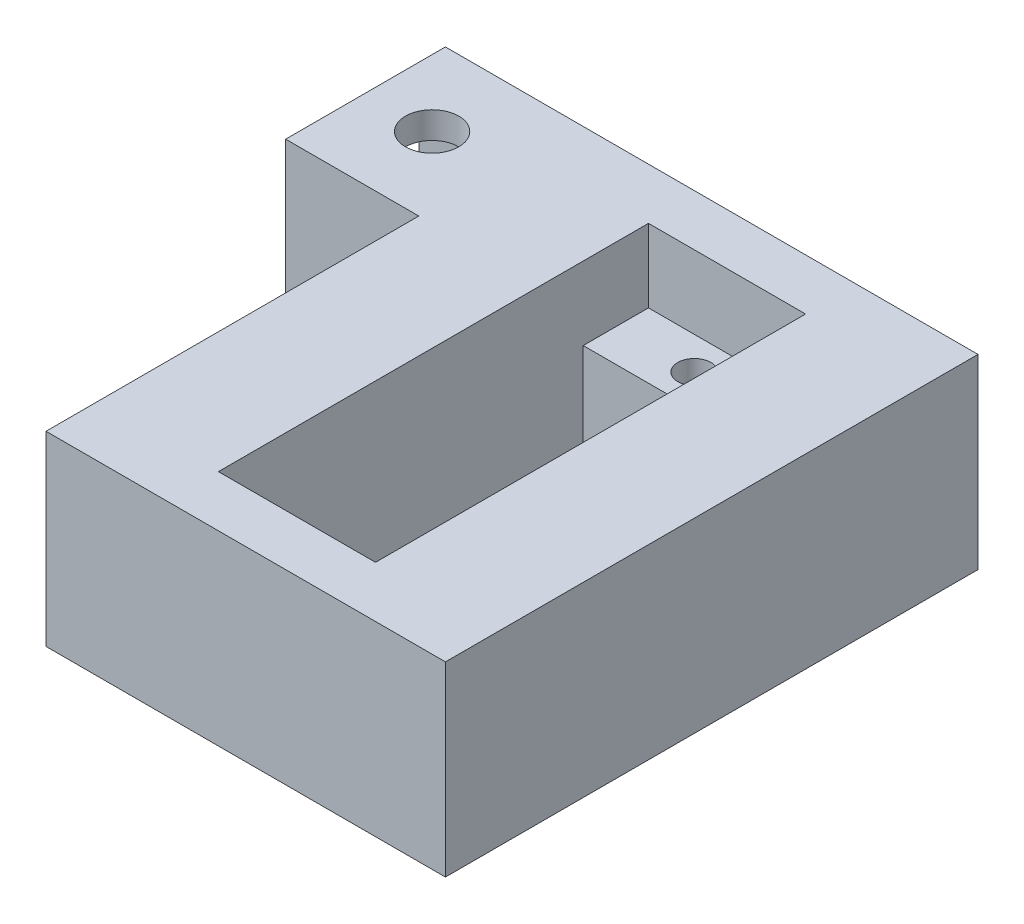
ISO-10303-21;
HEADER;
FILE_DESCRIPTION(('STEP AP214'),'2;1');
FILE_NAME('part.step','',(''),(''),'','','');
FILE_SCHEMA(('AUTOMOTIVE_DESIGN { 1 0 10303 214 1 1 1 1 }'));
ENDSEC;
DATA;
#1=APPLICATION_CONTEXT('core data for automotive mechanical design processes');
#2=APPLICATION_PROTOCOL_DEFINITION('international standard','automotive_design',2000,#1);
#3=PRODUCT_CONTEXT('',#1,'mechanical');
#4=PRODUCT('Part','Part','',(#3));
#5=PRODUCT_RELATED_PRODUCT_CATEGORY('part','',(#4));
#6=PRODUCT_DEFINITION_FORMATION('','',#4);
#7=PRODUCT_DEFINITION_CONTEXT('part definition',#1,'design');
#8=PRODUCT_DEFINITION('design','',#6,#7);
#9=PRODUCT_DEFINITION_SHAPE('','',#8);
#10=(LENGTH_UNIT() NAMED_UNIT(*) SI_UNIT(.MILLI.,.METRE.));
#11=(NAMED_UNIT(*) PLANE_ANGLE_UNIT() SI_UNIT($,.RADIAN.));
#12=(NAMED_UNIT(*) SI_UNIT($,.STERADIAN.) SOLID_ANGLE_UNIT());
#13=UNCERTAINTY_MEASURE_WITH_UNIT(LENGTH_MEASURE(1.E-05),#10,'distance_accuracy_value','');
#14=(GEOMETRIC_REPRESENTATION_CONTEXT(3) GLOBAL_UNCERTAINTY_ASSIGNED_CONTEXT((#13)) GLOBAL_UNIT_ASSIGNED_CONTEXT((#10,
#11,#12)) REPRESENTATION_CONTEXT('',''));
#15=CARTESIAN_POINT('',(0.,0.,0.));
#16=DIRECTION('',(0.,0.,1.));
#17=DIRECTION('',(1.,0.,0.));
#18=AXIS2_PLACEMENT_3D('',#15,#16,#17);
#19=CARTESIAN_POINT('',(-21.329047434942,9.00358715260278,40.));
#20=DIRECTION('',(1.,0.,0.));
#21=DIRECTION('',(0.,0.,-1.));
#22=AXIS2_PLACEMENT_3D('',#19,#20,#21);
#23=PLANE('',#22);
#24=DIRECTION('',(0.,1.,0.));
#25=VECTOR('',#24,1.);
#26=CARTESIAN_POINT('',(-21.329047434942,9.00358715260278,12.));
#27=LINE('',#26,#25);
#28=CARTESIAN_POINT('',(-21.329047434942,-4.99526108798895,12.));
#29=VERTEX_POINT('',#28);
#30=CARTESIAN_POINT('',(-21.329047434942,9.00358715260278,12.));
#31=VERTEX_POINT('',#30);
#32=EDGE_CURVE('E66',#29,#31,#27,.T.);
#33=ORIENTED_EDGE('',*,*,#32,.F.);
#34=DIRECTION('',(0.,0.,-1.));
#35=VECTOR('',#34,1.);
#36=CARTESIAN_POINT('',(-21.329047434942,-4.99526108798895,40.));
#37=LINE('',#36,#35);
#38=CARTESIAN_POINT('',(-21.329047434942,-4.99526108798895,40.));
#39=VERTEX_POINT('',#38);
#40=EDGE_CURVE('E370',#39,#29,#37,.T.);
#41=ORIENTED_EDGE('',*,*,#40,.F.);
#42=DIRECTION('',(0.,-1.,0.));
#43=VECTOR('',#42,1.);
#44=CARTESIAN_POINT('',(-21.329047434942,9.00358715260278,40.));
#45=LINE('',#44,#43);
#46=CARTESIAN_POINT('',(-21.329047434942,9.00358715260278,40.));
#47=VERTEX_POINT('',#46);
#48=EDGE_CURVE('E352',#47,#39,#45,.T.);
#49=ORIENTED_EDGE('',*,*,#48,.F.);
#50=DIRECTION('',(0.,0.,-1.));
#51=VECTOR('',#50,1.);
#52=CARTESIAN_POINT('',(-21.329047434942,9.00358715260278,40.));
#53=LINE('',#52,#51);
#54=EDGE_CURVE('E50',#47,#31,#53,.T.);
#55=ORIENTED_EDGE('',*,*,#54,.T.);
#56=EDGE_LOOP('',(#33,#41,#49,#55));
#57=FACE_BOUND('',#56,.T.);
#58=ADVANCED_FACE('F40',(#57),#23,.F.);
#59=CARTESIAN_POINT('',(0.,3.50358715260278,0.));
#60=DIRECTION('',(0.,1.,0.));
#61=DIRECTION('',(0.,0.,1.));
#62=AXIS2_PLACEMENT_3D('',#59,#60,#61);
#63=PLANE('',#62);
#64=CARTESIAN_POINT('',(-6.32904743494199,3.50358715260278,33.7));
#65=DIRECTION('',(0.,1.,0.));
#66=DIRECTION('',(0.,0.,1.));
#67=AXIS2_PLACEMENT_3D('',#64,#65,#66);
#68=CIRCLE('',#67,1.25);
#69=CARTESIAN_POINT('',(-6.32904743494199,3.50358715260278,34.95));
#70=VERTEX_POINT('',#69);
#71=EDGE_CURVE('E245',#70,#70,#68,.T.);
#72=ORIENTED_EDGE('',*,*,#71,.F.);
#73=EDGE_LOOP('',(#72));
#74=FACE_BOUND('',#73,.T.);
#75=DIRECTION('',(1.,0.,0.));
#76=VECTOR('',#75,1.);
#77=CARTESIAN_POINT('',(-12.229047434942,3.50358715260278,31.25));
#78=LINE('',#77,#76);
#79=CARTESIAN_POINT('',(-12.229047434942,3.50358715260278,31.25));
#80=VERTEX_POINT('',#79);
#81=CARTESIAN_POINT('',(-0.429047434941994,3.50358715260278,31.25));
#82=VERTEX_POINT('',#81);
#83=EDGE_CURVE('E250',#80,#82,#78,.T.);
#84=ORIENTED_EDGE('',*,*,#83,.F.);
#85=DIRECTION('',(0.,0.,1.));
#86=VECTOR('',#85,1.);
#87=CARTESIAN_POINT('',(-12.229047434942,3.50358715260278,3.85));
#88=LINE('',#87,#86);
#89=CARTESIAN_POINT('',(-12.229047434942,3.50358715260278,36.15));
#90=VERTEX_POINT('',#89);
#91=EDGE_CURVE('E303',#80,#90,#88,.T.);
#92=ORIENTED_EDGE('',*,*,#91,.T.);
#93=DIRECTION('',(1.,0.,0.));
#94=VECTOR('',#93,1.);
#95=CARTESIAN_POINT('',(-12.229047434942,3.50358715260278,36.15));
#96=LINE('',#95,#94);
#97=CARTESIAN_POINT('',(-0.429047434941994,3.50358715260278,36.15));
#98=VERTEX_POINT('',#97);
#99=EDGE_CURVE('E302',#90,#98,#96,.T.);
#100=ORIENTED_EDGE('',*,*,#99,.T.);
#101=DIRECTION('',(0.,0.,-1.));
#102=VECTOR('',#101,1.);
#103=CARTESIAN_POINT('',(-0.429047434941994,3.50358715260278,3.85));
#104=LINE('',#103,#102);
#105=EDGE_CURVE('E308',#98,#82,#104,.T.);
#106=ORIENTED_EDGE('',*,*,#105,.T.);
#107=EDGE_LOOP('',(#84,#92,#100,#106));
#108=FACE_BOUND('',#107,.T.);
#109=ADVANCED_FACE('F414',(#74,#108),#63,.T.);
#110=CARTESIAN_POINT('',(8.67095256505801,9.00358715260278,40.));
#111=DIRECTION('',(1.,0.,0.));
#112=DIRECTION('',(0.,0.,-1.));
#113=AXIS2_PLACEMENT_3D('',#110,#111,#112);
#114=PLANE('',#113);
#115=DIRECTION('',(0.,-1.,0.));
#116=VECTOR('',#115,1.);
#117=CARTESIAN_POINT('',(8.67095256505801,9.00358715260278,0.));
#118=LINE('',#117,#116);
#119=CARTESIAN_POINT('',(8.67095256505801,9.00358715260278,0.));
#120=VERTEX_POINT('',#119);
#121=CARTESIAN_POINT('',(8.67095256505801,-4.99526108798895,0.));
#122=VERTEX_POINT('',#121);
#123=EDGE_CURVE('E334',#120,#122,#118,.T.);
#124=ORIENTED_EDGE('',*,*,#123,.F.);
#125=DIRECTION('',(0.,0.,-1.));
#126=VECTOR('',#125,1.);
#127=CARTESIAN_POINT('',(8.67095256505801,9.00358715260278,40.));
#128=LINE('',#127,#126);
#129=CARTESIAN_POINT('',(8.67095256505801,9.00358715260278,40.));
#130=VERTEX_POINT('',#129);
#131=EDGE_CURVE('E11',#130,#120,#128,.T.);
#132=ORIENTED_EDGE('',*,*,#131,.F.);
#133=DIRECTION('',(0.,-1.,0.));
#134=VECTOR('',#133,1.);
#135=CARTESIAN_POINT('',(8.67095256505801,9.00358715260278,40.));
#136=LINE('',#135,#134);
#137=CARTESIAN_POINT('',(8.67095256505801,-4.99526108798895,40.));
#138=VERTEX_POINT('',#137);
#139=EDGE_CURVE('E344',#130,#138,#136,.T.);
#140=ORIENTED_EDGE('',*,*,#139,.T.);
#141=DIRECTION('',(0.,0.,-1.));
#142=VECTOR('',#141,1.);
#143=CARTESIAN_POINT('',(8.67095256505801,-4.99526108798895,40.));
#144=LINE('',#143,#142);
#145=EDGE_CURVE('E359',#138,#122,#144,.T.);
#146=ORIENTED_EDGE('',*,*,#145,.T.);
#147=EDGE_LOOP('',(#124,#132,#140,#146));
#148=FACE_BOUND('',#147,.T.);
#149=ADVANCED_FACE('F42',(#148),#114,.T.);
#150=CARTESIAN_POINT('',(8.67095256505801,9.00358715260278,40.));
#151=DIRECTION('',(0.,-1.,0.));
#152=DIRECTION('',(0.,0.,-1.));
#153=AXIS2_PLACEMENT_3D('',#150,#151,#152);
#154=PLANE('',#153);
#155=CARTESIAN_POINT('',(-26.329047434942,9.00358715260278,6.));
#156=DIRECTION('',(0.,1.,0.));
#157=DIRECTION('',(0.,0.,1.));
#158=AXIS2_PLACEMENT_3D('',#155,#156,#157);
#159=CIRCLE('',#158,2.);
#160=CARTESIAN_POINT('',(-26.329047434942,9.00358715260278,8.));
#161=VERTEX_POINT('',#160);
#162=EDGE_CURVE('E490',#161,#161,#159,.T.);
#163=ORIENTED_EDGE('',*,*,#162,.F.);
#164=EDGE_LOOP('',(#163));
#165=FACE_BOUND('',#164,.T.);
#166=DIRECTION('',(1.,0.,0.));
#167=VECTOR('',#166,1.);
#168=CARTESIAN_POINT('',(-12.229047434942,9.00358715260278,36.15));
#169=LINE('',#168,#167);
#170=CARTESIAN_POINT('',(-12.229047434942,9.00358715260278,36.15));
#171=VERTEX_POINT('',#170);
#172=CARTESIAN_POINT('',(-0.429047434941994,9.00358715260278,36.15));
#173=VERTEX_POINT('',#172);
#174=EDGE_CURVE('E319',#171,#173,#169,.T.);
#175=ORIENTED_EDGE('',*,*,#174,.F.);
#176=DIRECTION('',(0.,0.,1.));
#177=VECTOR('',#176,1.);
#178=CARTESIAN_POINT('',(-12.229047434942,9.00358715260278,3.85));
#179=LINE('',#178,#177);
#180=CARTESIAN_POINT('',(-12.229047434942,9.00358715260278,3.85));
#181=VERTEX_POINT('',#180);
#182=EDGE_CURVE('E289',#181,#171,#179,.T.);
#183=ORIENTED_EDGE('',*,*,#182,.F.);
#184=DIRECTION('',(-1.,0.,0.));
#185=VECTOR('',#184,1.);
#186=CARTESIAN_POINT('',(-12.229047434942,9.00358715260278,3.85));
#187=LINE('',#186,#185);
#188=CARTESIAN_POINT('',(-0.429047434941994,9.00358715260278,3.85));
#189=VERTEX_POINT('',#188);
#190=EDGE_CURVE('E327',#189,#181,#187,.T.);
#191=ORIENTED_EDGE('',*,*,#190,.F.);
#192=DIRECTION('',(0.,0.,-1.));
#193=VECTOR('',#192,1.);
#194=CARTESIAN_POINT('',(-0.429047434941994,9.00358715260278,3.85));
#195=LINE('',#194,#193);
#196=EDGE_CURVE('E323',#173,#189,#195,.T.);
#197=ORIENTED_EDGE('',*,*,#196,.F.);
#198=EDGE_LOOP('',(#175,#183,#191,#197));
#199=FACE_BOUND('',#198,.T.);
#200=DIRECTION('',(-1.,0.,0.));
#201=VECTOR('',#200,1.);
#202=CARTESIAN_POINT('',(8.67095256505801,9.00358715260278,0.));
#203=LINE('',#202,#201);
#204=CARTESIAN_POINT('',(-31.329047434942,9.00358715260278,0.));
#205=VERTEX_POINT('',#204);
#206=EDGE_CURVE('E349',#120,#205,#203,.T.);
#207=ORIENTED_EDGE('',*,*,#206,.T.);
#208=DIRECTION('',(0.,0.,-1.));
#209=VECTOR('',#208,1.);
#210=CARTESIAN_POINT('',(-31.329047434942,9.00358715260278,0.));
#211=LINE('',#210,#209);
#212=CARTESIAN_POINT('',(-31.329047434942,9.00358715260278,12.));
#213=VERTEX_POINT('',#212);
#214=EDGE_CURVE('E231',#213,#205,#211,.T.);
#215=ORIENTED_EDGE('',*,*,#214,.F.);
#216=DIRECTION('',(1.,0.,0.));
#217=VECTOR('',#216,1.);
#218=CARTESIAN_POINT('',(-31.329047434942,9.00358715260278,12.));
#219=LINE('',#218,#217);
#220=EDGE_CURVE('E235',#213,#31,#219,.T.);
#221=ORIENTED_EDGE('',*,*,#220,.T.);
#222=ORIENTED_EDGE('',*,*,#54,.F.);
#223=DIRECTION('',(-1.,0.,0.));
#224=VECTOR('',#223,1.);
#225=CARTESIAN_POINT('',(-11.329047434942,9.00358715260278,40.));
#226=LINE('',#225,#224);
#227=EDGE_CURVE('E356',#130,#47,#226,.T.);
#228=ORIENTED_EDGE('',*,*,#227,.F.);
#229=ORIENTED_EDGE('',*,*,#131,.T.);
#230=EDGE_LOOP('',(#207,#215,#221,#222,#228,#229));
#231=FACE_BOUND('',#230,.T.);
#232=ADVANCED_FACE('F387',(#165,#199,#231),#154,.F.);
#233=CARTESIAN_POINT('',(-21.329047434942,-4.99526108798895,40.));
#234=DIRECTION('',(0.,1.,0.));
#235=DIRECTION('',(0.,0.,1.));
#236=AXIS2_PLACEMENT_3D('',#233,#234,#235);
#237=PLANE('',#236);
#238=CARTESIAN_POINT('',(-26.329047434942,-4.99526108798895,6.));
#239=DIRECTION('',(0.,1.,0.));
#240=DIRECTION('',(0.,0.,1.));
#241=AXIS2_PLACEMENT_3D('',#238,#239,#240);
#242=CIRCLE('',#241,2.);
#243=CARTESIAN_POINT('',(-26.329047434942,-4.99526108798895,8.));
#244=VERTEX_POINT('',#243);
#245=EDGE_CURVE('E496',#244,#244,#242,.T.);
#246=ORIENTED_EDGE('',*,*,#245,.T.);
#247=EDGE_LOOP('',(#246));
#248=FACE_BOUND('',#247,.T.);
#249=CARTESIAN_POINT('',(-6.329047434942,-4.99526108798895,6.3));
#250=DIRECTION('',(0.,1.,0.));
#251=DIRECTION('',(0.,0.,1.));
#252=AXIS2_PLACEMENT_3D('',#249,#250,#251);
#253=CIRCLE('',#252,1.25);
#254=CARTESIAN_POINT('',(-6.329047434942,-4.99526108798895,7.55));
#255=VERTEX_POINT('',#254);
#256=EDGE_CURVE('E246',#255,#255,#253,.T.);
#257=ORIENTED_EDGE('',*,*,#256,.T.);
#258=EDGE_LOOP('',(#257));
#259=FACE_BOUND('',#258,.T.);
#260=CARTESIAN_POINT('',(-6.32904743494199,-4.99526108798895,33.7));
#261=DIRECTION('',(0.,1.,0.));
#262=DIRECTION('',(0.,0.,1.));
#263=AXIS2_PLACEMENT_3D('',#260,#261,#262);
#264=CIRCLE('',#263,1.25);
#265=CARTESIAN_POINT('',(-6.32904743494199,-4.99526108798895,34.95));
#266=VERTEX_POINT('',#265);
#267=EDGE_CURVE('E255',#266,#266,#264,.T.);
#268=ORIENTED_EDGE('',*,*,#267,.T.);
#269=EDGE_LOOP('',(#268));
#270=FACE_BOUND('',#269,.T.);
#271=DIRECTION('',(-1.,0.,0.));
#272=VECTOR('',#271,1.);
#273=CARTESIAN_POINT('',(-12.229047434942,-4.99526108798895,8.75));
#274=LINE('',#273,#272);
#275=CARTESIAN_POINT('',(-0.429047434941994,-4.99526108798895,8.75));
#276=VERTEX_POINT('',#275);
#277=CARTESIAN_POINT('',(-12.229047434942,-4.99526108798895,8.75));
#278=VERTEX_POINT('',#277);
#279=EDGE_CURVE('E275',#276,#278,#274,.T.);
#280=ORIENTED_EDGE('',*,*,#279,.T.);
#281=DIRECTION('',(0.,0.,1.));
#282=VECTOR('',#281,1.);
#283=CARTESIAN_POINT('',(-12.229047434942,-4.99526108798895,8.75));
#284=LINE('',#283,#282);
#285=CARTESIAN_POINT('',(-12.229047434942,-4.99526108798895,31.25));
#286=VERTEX_POINT('',#285);
#287=EDGE_CURVE('E262',#278,#286,#284,.T.);
#288=ORIENTED_EDGE('',*,*,#287,.T.);
#289=DIRECTION('',(1.,0.,0.));
#290=VECTOR('',#289,1.);
#291=CARTESIAN_POINT('',(-12.229047434942,-4.99526108798895,31.25));
#292=LINE('',#291,#290);
#293=CARTESIAN_POINT('',(-0.429047434941994,-4.99526108798895,31.25));
#294=VERTEX_POINT('',#293);
#295=EDGE_CURVE('E266',#286,#294,#292,.T.);
#296=ORIENTED_EDGE('',*,*,#295,.T.);
#297=DIRECTION('',(0.,0.,-1.));
#298=VECTOR('',#297,1.);
#299=CARTESIAN_POINT('',(-0.429047434941994,-4.99526108798895,8.75));
#300=LINE('',#299,#298);
#301=EDGE_CURVE('E271',#294,#276,#300,.T.);
#302=ORIENTED_EDGE('',*,*,#301,.T.);
#303=EDGE_LOOP('',(#280,#288,#296,#302));
#304=FACE_BOUND('',#303,.T.);
#305=DIRECTION('',(1.,0.,0.));
#306=VECTOR('',#305,1.);
#307=CARTESIAN_POINT('',(-21.329047434942,-4.99526108798895,0.));
#308=LINE('',#307,#306);
#309=CARTESIAN_POINT('',(-31.329047434942,-4.99526108798895,0.));
#310=VERTEX_POINT('',#309);
#311=EDGE_CURVE('E363',#310,#122,#308,.T.);
#312=ORIENTED_EDGE('',*,*,#311,.T.);
#313=ORIENTED_EDGE('',*,*,#145,.F.);
#314=DIRECTION('',(1.,0.,0.));
#315=VECTOR('',#314,1.);
#316=CARTESIAN_POINT('',(-11.329047434942,-4.99526108798895,40.));
#317=LINE('',#316,#315);
#318=EDGE_CURVE('E348',#39,#138,#317,.T.);
#319=ORIENTED_EDGE('',*,*,#318,.F.);
#320=ORIENTED_EDGE('',*,*,#40,.T.);
#321=DIRECTION('',(1.,0.,0.));
#322=VECTOR('',#321,1.);
#323=CARTESIAN_POINT('',(-31.329047434942,-4.99526108798895,12.));
#324=LINE('',#323,#322);
#325=CARTESIAN_POINT('',(-31.329047434942,-4.99526108798895,12.));
#326=VERTEX_POINT('',#325);
#327=EDGE_CURVE('E241',#326,#29,#324,.T.);
#328=ORIENTED_EDGE('',*,*,#327,.F.);
#329=DIRECTION('',(0.,0.,1.));
#330=VECTOR('',#329,1.);
#331=CARTESIAN_POINT('',(-31.329047434942,-4.99526108798895,0.));
#332=LINE('',#331,#330);
#333=EDGE_CURVE('E225',#310,#326,#332,.T.);
#334=ORIENTED_EDGE('',*,*,#333,.F.);
#335=EDGE_LOOP('',(#312,#313,#319,#320,#328,#334));
#336=FACE_BOUND('',#335,.T.);
#337=ADVANCED_FACE('F399',(#248,#259,#270,#304,#336),#237,.F.);
#338=CARTESIAN_POINT('',(0.,0.,40.));
#339=DIRECTION('',(0.,0.,1.));
#340=DIRECTION('',(1.,0.,0.));
#341=AXIS2_PLACEMENT_3D('',#338,#339,#340);
#342=PLANE('',#341);
#343=ORIENTED_EDGE('',*,*,#139,.F.);
#344=ORIENTED_EDGE('',*,*,#227,.T.);
#345=ORIENTED_EDGE('',*,*,#48,.T.);
#346=ORIENTED_EDGE('',*,*,#318,.T.);
#347=EDGE_LOOP('',(#343,#344,#345,#346));
#348=FACE_BOUND('',#347,.T.);
#349=ADVANCED_FACE('F398',(#348),#342,.T.);
#350=CARTESIAN_POINT('',(0.,0.,0.));
#351=DIRECTION('',(0.,0.,1.));
#352=DIRECTION('',(1.,0.,0.));
#353=AXIS2_PLACEMENT_3D('',#350,#351,#352);
#354=PLANE('',#353);
#355=ORIENTED_EDGE('',*,*,#123,.T.);
#356=ORIENTED_EDGE('',*,*,#311,.F.);
#357=DIRECTION('',(0.,-1.,0.));
#358=VECTOR('',#357,1.);
#359=CARTESIAN_POINT('',(-31.329047434942,9.00358715260278,0.));
#360=LINE('',#359,#358);
#361=EDGE_CURVE('E221',#205,#310,#360,.T.);
#362=ORIENTED_EDGE('',*,*,#361,.F.);
#363=ORIENTED_EDGE('',*,*,#206,.F.);
#364=EDGE_LOOP('',(#355,#356,#362,#363));
#365=FACE_BOUND('',#364,.T.);
#366=ADVANCED_FACE('F382',(#365),#354,.F.);
#367=CARTESIAN_POINT('',(-12.229047434942,3.50358715260278,3.85));
#368=DIRECTION('',(-1.,0.,0.));
#369=DIRECTION('',(0.,0.,1.));
#370=AXIS2_PLACEMENT_3D('',#367,#368,#369);
#371=PLANE('',#370);
#372=ORIENTED_EDGE('',*,*,#182,.T.);
#373=DIRECTION('',(0.,1.,0.));
#374=VECTOR('',#373,1.);
#375=CARTESIAN_POINT('',(-12.229047434942,3.50358715260278,36.15));
#376=LINE('',#375,#374);
#377=EDGE_CURVE('E316',#90,#171,#376,.T.);
#378=ORIENTED_EDGE('',*,*,#377,.F.);
#379=ORIENTED_EDGE('',*,*,#91,.F.);
#380=DIRECTION('',(0.,1.,0.));
#381=VECTOR('',#380,1.);
#382=CARTESIAN_POINT('',(-12.229047434942,-4.99526108798895,31.25));
#383=LINE('',#382,#381);
#384=EDGE_CURVE('E279',#286,#80,#383,.T.);
#385=ORIENTED_EDGE('',*,*,#384,.F.);
#386=ORIENTED_EDGE('',*,*,#287,.F.);
#387=DIRECTION('',(0.,1.,0.));
#388=VECTOR('',#387,1.);
#389=CARTESIAN_POINT('',(-12.229047434942,-4.99526108798895,8.75));
#390=LINE('',#389,#388);
#391=CARTESIAN_POINT('',(-12.229047434942,3.50358715260278,8.75));
#392=VERTEX_POINT('',#391);
#393=EDGE_CURVE('E286',#278,#392,#390,.T.);
#394=ORIENTED_EDGE('',*,*,#393,.T.);
#395=CARTESIAN_POINT('',(-12.229047434942,3.50358715260278,3.85));
#396=VERTEX_POINT('',#395);
#397=EDGE_CURVE('E298',#396,#392,#88,.T.);
#398=ORIENTED_EDGE('',*,*,#397,.F.);
#399=DIRECTION('',(0.,1.,0.));
#400=VECTOR('',#399,1.);
#401=CARTESIAN_POINT('',(-12.229047434942,3.50358715260278,3.85));
#402=LINE('',#401,#400);
#403=EDGE_CURVE('E331',#396,#181,#402,.T.);
#404=ORIENTED_EDGE('',*,*,#403,.T.);
#405=EDGE_LOOP('',(#372,#378,#379,#385,#386,#394,#398,#404));
#406=FACE_BOUND('',#405,.T.);
#407=ADVANCED_FACE('F425',(#406),#371,.F.);
#408=CARTESIAN_POINT('',(-12.229047434942,3.50358715260278,3.85));
#409=DIRECTION('',(0.,0.,-1.));
#410=DIRECTION('',(-1.,0.,0.));
#411=AXIS2_PLACEMENT_3D('',#408,#409,#410);
#412=PLANE('',#411);
#413=ORIENTED_EDGE('',*,*,#190,.T.);
#414=ORIENTED_EDGE('',*,*,#403,.F.);
#415=DIRECTION('',(-1.,0.,0.));
#416=VECTOR('',#415,1.);
#417=CARTESIAN_POINT('',(-12.229047434942,3.50358715260278,3.85));
#418=LINE('',#417,#416);
#419=CARTESIAN_POINT('',(-0.429047434941994,3.50358715260278,3.85));
#420=VERTEX_POINT('',#419);
#421=EDGE_CURVE('E312',#420,#396,#418,.T.);
#422=ORIENTED_EDGE('',*,*,#421,.F.);
#423=DIRECTION('',(0.,1.,0.));
#424=VECTOR('',#423,1.);
#425=CARTESIAN_POINT('',(-0.429047434941994,3.50358715260278,3.85));
#426=LINE('',#425,#424);
#427=EDGE_CURVE('E335',#420,#189,#426,.T.);
#428=ORIENTED_EDGE('',*,*,#427,.T.);
#429=EDGE_LOOP('',(#413,#414,#422,#428));
#430=FACE_BOUND('',#429,.T.);
#431=ADVANCED_FACE('F429',(#430),#412,.F.);
#432=CARTESIAN_POINT('',(-0.429047434941994,3.50358715260278,3.85));
#433=DIRECTION('',(1.,0.,0.));
#434=DIRECTION('',(0.,0.,-1.));
#435=AXIS2_PLACEMENT_3D('',#432,#433,#434);
#436=PLANE('',#435);
#437=ORIENTED_EDGE('',*,*,#196,.T.);
#438=ORIENTED_EDGE('',*,*,#427,.F.);
#439=CARTESIAN_POINT('',(-0.429047434941994,3.50358715260278,8.75));
#440=VERTEX_POINT('',#439);
#441=EDGE_CURVE('E307',#440,#420,#104,.T.);
#442=ORIENTED_EDGE('',*,*,#441,.F.);
#443=DIRECTION('',(0.,1.,0.));
#444=VECTOR('',#443,1.);
#445=CARTESIAN_POINT('',(-0.429047434941994,-4.99526108798895,8.75));
#446=LINE('',#445,#444);
#447=EDGE_CURVE('E290',#276,#440,#446,.T.);
#448=ORIENTED_EDGE('',*,*,#447,.F.);
#449=ORIENTED_EDGE('',*,*,#301,.F.);
#450=DIRECTION('',(0.,1.,0.));
#451=VECTOR('',#450,1.);
#452=CARTESIAN_POINT('',(-0.429047434941994,-4.99526108798895,31.25));
#453=LINE('',#452,#451);
#454=EDGE_CURVE('E293',#294,#82,#453,.T.);
#455=ORIENTED_EDGE('',*,*,#454,.T.);
#456=ORIENTED_EDGE('',*,*,#105,.F.);
#457=DIRECTION('',(0.,1.,0.));
#458=VECTOR('',#457,1.);
#459=CARTESIAN_POINT('',(-0.429047434941994,3.50358715260278,36.15));
#460=LINE('',#459,#458);
#461=EDGE_CURVE('E338',#98,#173,#460,.T.);
#462=ORIENTED_EDGE('',*,*,#461,.T.);
#463=EDGE_LOOP('',(#437,#438,#442,#448,#449,#455,#456,#462));
#464=FACE_BOUND('',#463,.T.);
#465=ADVANCED_FACE('F434',(#464),#436,.F.);
#466=CARTESIAN_POINT('',(-12.229047434942,3.50358715260278,36.15));
#467=DIRECTION('',(0.,0.,1.));
#468=DIRECTION('',(1.,0.,0.));
#469=AXIS2_PLACEMENT_3D('',#466,#467,#468);
#470=PLANE('',#469);
#471=ORIENTED_EDGE('',*,*,#174,.T.);
#472=ORIENTED_EDGE('',*,*,#461,.F.);
#473=ORIENTED_EDGE('',*,*,#99,.F.);
#474=ORIENTED_EDGE('',*,*,#377,.T.);
#475=EDGE_LOOP('',(#471,#472,#473,#474));
#476=FACE_BOUND('',#475,.T.);
#477=ADVANCED_FACE('F431',(#476),#470,.F.);
#478=CARTESIAN_POINT('',(-6.329047434942,3.50358715260278,6.3));
#479=DIRECTION('',(0.,1.,0.));
#480=DIRECTION('',(0.,0.,1.));
#481=AXIS2_PLACEMENT_3D('',#478,#479,#480);
#482=CIRCLE('',#481,1.25);
#483=CARTESIAN_POINT('',(-6.329047434942,3.50358715260278,7.55));
#484=VERTEX_POINT('',#483);
#485=EDGE_CURVE('E251',#484,#484,#482,.T.);
#486=ORIENTED_EDGE('',*,*,#485,.F.);
#487=EDGE_LOOP('',(#486));
#488=FACE_BOUND('',#487,.T.);
#489=DIRECTION('',(-1.,0.,0.));
#490=VECTOR('',#489,1.);
#491=CARTESIAN_POINT('',(-12.229047434942,3.50358715260278,8.75));
#492=LINE('',#491,#490);
#493=EDGE_CURVE('E267',#440,#392,#492,.T.);
#494=ORIENTED_EDGE('',*,*,#493,.F.);
#495=ORIENTED_EDGE('',*,*,#441,.T.);
#496=ORIENTED_EDGE('',*,*,#421,.T.);
#497=ORIENTED_EDGE('',*,*,#397,.T.);
#498=EDGE_LOOP('',(#494,#495,#496,#497));
#499=FACE_BOUND('',#498,.T.);
#500=ADVANCED_FACE('F422',(#488,#499),#63,.T.);
#501=CARTESIAN_POINT('',(-12.229047434942,-4.99526108798895,8.75));
#502=DIRECTION('',(0.,0.,-1.));
#503=DIRECTION('',(-1.,0.,0.));
#504=AXIS2_PLACEMENT_3D('',#501,#502,#503);
#505=PLANE('',#504);
#506=ORIENTED_EDGE('',*,*,#493,.T.);
#507=ORIENTED_EDGE('',*,*,#393,.F.);
#508=ORIENTED_EDGE('',*,*,#279,.F.);
#509=ORIENTED_EDGE('',*,*,#447,.T.);
#510=EDGE_LOOP('',(#506,#507,#508,#509));
#511=FACE_BOUND('',#510,.T.);
#512=ADVANCED_FACE('F443',(#511),#505,.F.);
#513=CARTESIAN_POINT('',(-12.229047434942,-4.99526108798895,31.25));
#514=DIRECTION('',(0.,0.,1.));
#515=DIRECTION('',(1.,0.,0.));
#516=AXIS2_PLACEMENT_3D('',#513,#514,#515);
#517=PLANE('',#516);
#518=ORIENTED_EDGE('',*,*,#83,.T.);
#519=ORIENTED_EDGE('',*,*,#454,.F.);
#520=ORIENTED_EDGE('',*,*,#295,.F.);
#521=ORIENTED_EDGE('',*,*,#384,.T.);
#522=EDGE_LOOP('',(#518,#519,#520,#521));
#523=FACE_BOUND('',#522,.T.);
#524=ADVANCED_FACE('F445',(#523),#517,.F.);
#525=CARTESIAN_POINT('',(-6.329047434942,-4.99526108798895,6.3));
#526=DIRECTION('',(0.,1.,0.));
#527=DIRECTION('',(0.,0.,1.));
#528=AXIS2_PLACEMENT_3D('',#525,#526,#527);
#529=CYLINDRICAL_SURFACE('',#528,1.25);
#530=ORIENTED_EDGE('',*,*,#256,.F.);
#531=EDGE_LOOP('',(#530));
#532=FACE_BOUND('',#531,.T.);
#533=ORIENTED_EDGE('',*,*,#485,.T.);
#534=EDGE_LOOP('',(#533));
#535=FACE_BOUND('',#534,.T.);
#536=ADVANCED_FACE('F448',(#532,#535),#529,.F.);
#537=CARTESIAN_POINT('',(-6.32904743494199,-4.99526108798895,33.7));
#538=DIRECTION('',(0.,1.,0.));
#539=DIRECTION('',(0.,0.,1.));
#540=AXIS2_PLACEMENT_3D('',#537,#538,#539);
#541=CYLINDRICAL_SURFACE('',#540,1.25);
#542=ORIENTED_EDGE('',*,*,#267,.F.);
#543=EDGE_LOOP('',(#542));
#544=FACE_BOUND('',#543,.T.);
#545=ORIENTED_EDGE('',*,*,#71,.T.);
#546=EDGE_LOOP('',(#545));
#547=FACE_BOUND('',#546,.T.);
#548=ADVANCED_FACE('F453',(#544,#547),#541,.F.);
#549=CARTESIAN_POINT('',(-31.329047434942,9.00358715260278,12.));
#550=DIRECTION('',(0.,0.,-1.));
#551=DIRECTION('',(-1.,0.,0.));
#552=AXIS2_PLACEMENT_3D('',#549,#550,#551);
#553=PLANE('',#552);
#554=ORIENTED_EDGE('',*,*,#32,.T.);
#555=ORIENTED_EDGE('',*,*,#220,.F.);
#556=DIRECTION('',(0.,1.,0.));
#557=VECTOR('',#556,1.);
#558=CARTESIAN_POINT('',(-31.329047434942,9.00358715260278,12.));
#559=LINE('',#558,#557);
#560=EDGE_CURVE('E228',#326,#213,#559,.T.);
#561=ORIENTED_EDGE('',*,*,#560,.F.);
#562=ORIENTED_EDGE('',*,*,#327,.T.);
#563=EDGE_LOOP('',(#554,#555,#561,#562));
#564=FACE_BOUND('',#563,.T.);
#565=ADVANCED_FACE('F394',(#564),#553,.F.);
#566=CARTESIAN_POINT('',(-31.329047434942,0.,0.));
#567=DIRECTION('',(-1.,0.,0.));
#568=DIRECTION('',(0.,0.,1.));
#569=AXIS2_PLACEMENT_3D('',#566,#567,#568);
#570=PLANE('',#569);
#571=DIRECTION('',(0.,-1.,0.));
#572=VECTOR('',#571,1.);
#573=CARTESIAN_POINT('',(-31.329047434942,7.00358715260278,2.));
#574=LINE('',#573,#572);
#575=CARTESIAN_POINT('',(-31.329047434942,7.00358715260278,2.));
#576=VERTEX_POINT('',#575);
#577=CARTESIAN_POINT('',(-31.329047434942,-2.99526108798895,2.));
#578=VERTEX_POINT('',#577);
#579=EDGE_CURVE('E58',#576,#578,#574,.T.);
#580=ORIENTED_EDGE('',*,*,#579,.F.);
#581=DIRECTION('',(0.,0.,-1.));
#582=VECTOR('',#581,1.);
#583=CARTESIAN_POINT('',(-31.329047434942,7.00358715260278,2.));
#584=LINE('',#583,#582);
#585=CARTESIAN_POINT('',(-31.329047434942,7.00358715260278,10.));
#586=VERTEX_POINT('',#585);
#587=EDGE_CURVE('E191',#586,#576,#584,.T.);
#588=ORIENTED_EDGE('',*,*,#587,.F.);
#589=DIRECTION('',(0.,1.,0.));
#590=VECTOR('',#589,1.);
#591=CARTESIAN_POINT('',(-31.329047434942,7.00358715260278,10.));
#592=LINE('',#591,#590);
#593=CARTESIAN_POINT('',(-31.329047434942,-2.99526108798895,10.));
#594=VERTEX_POINT('',#593);
#595=EDGE_CURVE('E195',#594,#586,#592,.T.);
#596=ORIENTED_EDGE('',*,*,#595,.F.);
#597=DIRECTION('',(0.,0.,1.));
#598=VECTOR('',#597,1.);
#599=CARTESIAN_POINT('',(-31.329047434942,-2.99526108798895,2.));
#600=LINE('',#599,#598);
#601=EDGE_CURVE('E207',#578,#594,#600,.T.);
#602=ORIENTED_EDGE('',*,*,#601,.F.);
#603=EDGE_LOOP('',(#580,#588,#596,#602));
#604=FACE_BOUND('',#603,.T.);
#605=ORIENTED_EDGE('',*,*,#361,.T.);
#606=ORIENTED_EDGE('',*,*,#333,.T.);
#607=ORIENTED_EDGE('',*,*,#560,.T.);
#608=ORIENTED_EDGE('',*,*,#214,.T.);
#609=EDGE_LOOP('',(#605,#606,#607,#608));
#610=FACE_BOUND('',#609,.T.);
#611=ADVANCED_FACE('F389',(#604,#610),#570,.T.);
#612=CARTESIAN_POINT('',(-21.329047434942,7.00358715260278,2.));
#613=DIRECTION('',(0.,0.,-1.));
#614=DIRECTION('',(0.,1.,0.));
#615=AXIS2_PLACEMENT_3D('',#612,#613,#614);
#616=PLANE('',#615);
#617=ORIENTED_EDGE('',*,*,#579,.T.);
#618=DIRECTION('',(-1.,0.,0.));
#619=VECTOR('',#618,1.);
#620=CARTESIAN_POINT('',(-21.329047434942,-2.99526108798895,2.));
#621=LINE('',#620,#619);
#622=CARTESIAN_POINT('',(-21.329047434942,-2.99526108798895,2.));
#623=VERTEX_POINT('',#622);
#624=EDGE_CURVE('E166',#623,#578,#621,.T.);
#625=ORIENTED_EDGE('',*,*,#624,.F.);
#626=DIRECTION('',(0.,-1.,0.));
#627=VECTOR('',#626,1.);
#628=CARTESIAN_POINT('',(-21.329047434942,7.00358715260278,2.));
#629=LINE('',#628,#627);
#630=CARTESIAN_POINT('',(-21.329047434942,7.00358715260278,2.));
#631=VERTEX_POINT('',#630);
#632=EDGE_CURVE('E170',#631,#623,#629,.T.);
#633=ORIENTED_EDGE('',*,*,#632,.F.);
#634=DIRECTION('',(-1.,0.,0.));
#635=VECTOR('',#634,1.);
#636=CARTESIAN_POINT('',(-21.329047434942,7.00358715260278,2.));
#637=LINE('',#636,#635);
#638=EDGE_CURVE('E213',#631,#576,#637,.T.);
#639=ORIENTED_EDGE('',*,*,#638,.T.);
#640=EDGE_LOOP('',(#617,#625,#633,#639));
#641=FACE_BOUND('',#640,.T.);
#642=ADVANCED_FACE('F168',(#641),#616,.F.);
#643=CARTESIAN_POINT('',(-21.329047434942,7.00358715260278,2.));
#644=DIRECTION('',(0.,1.,0.));
#645=DIRECTION('',(0.,0.,1.));
#646=AXIS2_PLACEMENT_3D('',#643,#644,#645);
#647=PLANE('',#646);
#648=CARTESIAN_POINT('',(-26.329047434942,7.00358715260278,6.));
#649=DIRECTION('',(0.,1.,0.));
#650=DIRECTION('',(0.,0.,1.));
#651=AXIS2_PLACEMENT_3D('',#648,#649,#650);
#652=CIRCLE('',#651,2.);
#653=CARTESIAN_POINT('',(-26.329047434942,7.00358715260278,8.));
#654=VERTEX_POINT('',#653);
#655=EDGE_CURVE('E198',#654,#654,#652,.T.);
#656=ORIENTED_EDGE('',*,*,#655,.T.);
#657=EDGE_LOOP('',(#656));
#658=FACE_BOUND('',#657,.T.);
#659=ORIENTED_EDGE('',*,*,#587,.T.);
#660=ORIENTED_EDGE('',*,*,#638,.F.);
#661=DIRECTION('',(0.,0.,-1.));
#662=VECTOR('',#661,1.);
#663=CARTESIAN_POINT('',(-21.329047434942,7.00358715260278,2.));
#664=LINE('',#663,#662);
#665=CARTESIAN_POINT('',(-21.329047434942,7.00358715260278,10.));
#666=VERTEX_POINT('',#665);
#667=EDGE_CURVE('E177',#666,#631,#664,.T.);
#668=ORIENTED_EDGE('',*,*,#667,.F.);
#669=DIRECTION('',(-1.,0.,0.));
#670=VECTOR('',#669,1.);
#671=CARTESIAN_POINT('',(-21.329047434942,7.00358715260278,10.));
#672=LINE('',#671,#670);
#673=EDGE_CURVE('E216',#666,#586,#672,.T.);
#674=ORIENTED_EDGE('',*,*,#673,.T.);
#675=EDGE_LOOP('',(#659,#660,#668,#674));
#676=FACE_BOUND('',#675,.T.);
#677=ADVANCED_FACE('F467',(#658,#676),#647,.F.);
#678=CARTESIAN_POINT('',(-21.329047434942,7.00358715260278,10.));
#679=DIRECTION('',(0.,0.,1.));
#680=DIRECTION('',(0.,-1.,0.));
#681=AXIS2_PLACEMENT_3D('',#678,#679,#680);
#682=PLANE('',#681);
#683=ORIENTED_EDGE('',*,*,#595,.T.);
#684=ORIENTED_EDGE('',*,*,#673,.F.);
#685=DIRECTION('',(0.,1.,0.));
#686=VECTOR('',#685,1.);
#687=CARTESIAN_POINT('',(-21.329047434942,7.00358715260278,10.));
#688=LINE('',#687,#686);
#689=CARTESIAN_POINT('',(-21.329047434942,-2.99526108798895,10.));
#690=VERTEX_POINT('',#689);
#691=EDGE_CURVE('E186',#690,#666,#688,.T.);
#692=ORIENTED_EDGE('',*,*,#691,.F.);
#693=DIRECTION('',(-1.,0.,0.));
#694=VECTOR('',#693,1.);
#695=CARTESIAN_POINT('',(-21.329047434942,-2.99526108798895,10.));
#696=LINE('',#695,#694);
#697=EDGE_CURVE('E176',#690,#594,#696,.T.);
#698=ORIENTED_EDGE('',*,*,#697,.T.);
#699=EDGE_LOOP('',(#683,#684,#692,#698));
#700=FACE_BOUND('',#699,.T.);
#701=ADVANCED_FACE('F470',(#700),#682,.F.);
#702=CARTESIAN_POINT('',(-21.329047434942,-2.99526108798895,2.));
#703=DIRECTION('',(0.,-1.,0.));
#704=DIRECTION('',(0.,0.,-1.));
#705=AXIS2_PLACEMENT_3D('',#702,#703,#704);
#706=PLANE('',#705);
#707=CARTESIAN_POINT('',(-26.329047434942,-2.99526108798895,6.));
#708=DIRECTION('',(0.,-1.,0.));
#709=DIRECTION('',(0.,0.,-1.));
#710=AXIS2_PLACEMENT_3D('',#707,#708,#709);
#711=CIRCLE('',#710,2.);
#712=CARTESIAN_POINT('',(-26.329047434942,-2.99526108798895,4.));
#713=VERTEX_POINT('',#712);
#714=EDGE_CURVE('E44',#713,#713,#711,.T.);
#715=ORIENTED_EDGE('',*,*,#714,.T.);
#716=EDGE_LOOP('',(#715));
#717=FACE_BOUND('',#716,.T.);
#718=ORIENTED_EDGE('',*,*,#601,.T.);
#719=ORIENTED_EDGE('',*,*,#697,.F.);
#720=DIRECTION('',(0.,0.,1.));
#721=VECTOR('',#720,1.);
#722=CARTESIAN_POINT('',(-21.329047434942,-2.99526108798895,2.));
#723=LINE('',#722,#721);
#724=EDGE_CURVE('E180',#623,#690,#723,.T.);
#725=ORIENTED_EDGE('',*,*,#724,.F.);
#726=ORIENTED_EDGE('',*,*,#624,.T.);
#727=EDGE_LOOP('',(#718,#719,#725,#726));
#728=FACE_BOUND('',#727,.T.);
#729=ADVANCED_FACE('F181',(#717,#728),#706,.F.);
#730=CARTESIAN_POINT('',(-21.329047434942,0.,0.));
#731=DIRECTION('',(-1.,0.,0.));
#732=DIRECTION('',(0.,0.,1.));
#733=AXIS2_PLACEMENT_3D('',#730,#731,#732);
#734=PLANE('',#733);
#735=ORIENTED_EDGE('',*,*,#632,.T.);
#736=ORIENTED_EDGE('',*,*,#724,.T.);
#737=ORIENTED_EDGE('',*,*,#691,.T.);
#738=ORIENTED_EDGE('',*,*,#667,.T.);
#739=EDGE_LOOP('',(#735,#736,#737,#738));
#740=FACE_BOUND('',#739,.T.);
#741=ADVANCED_FACE('F188',(#740),#734,.T.);
#742=CARTESIAN_POINT('',(-26.329047434942,-4.99526108798895,6.));
#743=DIRECTION('',(0.,1.,0.));
#744=DIRECTION('',(0.,0.,1.));
#745=AXIS2_PLACEMENT_3D('',#742,#743,#744);
#746=CYLINDRICAL_SURFACE('',#745,2.);
#747=ORIENTED_EDGE('',*,*,#245,.F.);
#748=EDGE_LOOP('',(#747));
#749=FACE_BOUND('',#748,.T.);
#750=ORIENTED_EDGE('',*,*,#714,.F.);
#751=EDGE_LOOP('',(#750));
#752=FACE_BOUND('',#751,.T.);
#753=ADVANCED_FACE('F479',(#749,#752),#746,.F.);
#754=ORIENTED_EDGE('',*,*,#162,.T.);
#755=EDGE_LOOP('',(#754));
#756=FACE_BOUND('',#755,.T.);
#757=ORIENTED_EDGE('',*,*,#655,.F.);
#758=EDGE_LOOP('',(#757));
#759=FACE_BOUND('',#758,.T.);
#760=ADVANCED_FACE('F480',(#756,#759),#746,.F.);
#761=CLOSED_SHELL('',(#58,#109,#149,#232,#337,#349,#366,#407,#431,#465,#477,#500,#512,#524,#536,
#548,#565,#611,#642,#677,#701,#729,#741,#753,#760));
#762=MANIFOLD_SOLID_BREP('B2',#761);
#763=ADVANCED_BREP_SHAPE_REPRESENTATION('',(#18,#762),#14);
#764=SHAPE_DEFINITION_REPRESENTATION(#9,#763);
ENDSEC;
END-ISO-10303-21;
